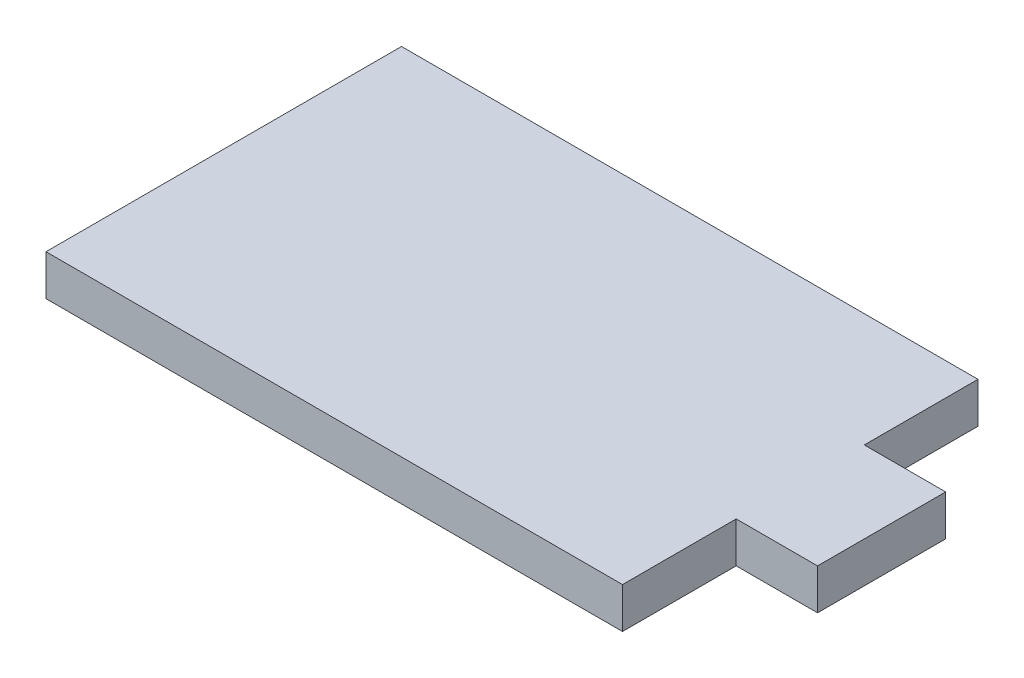
ISO-10303-21;
HEADER;
FILE_DESCRIPTION(('STEP AP214'),'2;1');
FILE_NAME('part.step','',(''),(''),'','','');
FILE_SCHEMA(('AUTOMOTIVE_DESIGN { 1 0 10303 214 1 1 1 1 }'));
ENDSEC;
DATA;
#1=APPLICATION_CONTEXT('core data for automotive mechanical design processes');
#2=APPLICATION_PROTOCOL_DEFINITION('international standard','automotive_design',2000,#1);
#3=PRODUCT_CONTEXT('',#1,'mechanical');
#4=PRODUCT('Part','Part','',(#3));
#5=PRODUCT_RELATED_PRODUCT_CATEGORY('part','',(#4));
#6=PRODUCT_DEFINITION_FORMATION('','',#4);
#7=PRODUCT_DEFINITION_CONTEXT('part definition',#1,'design');
#8=PRODUCT_DEFINITION('design','',#6,#7);
#9=PRODUCT_DEFINITION_SHAPE('','',#8);
#10=(LENGTH_UNIT() NAMED_UNIT(*) SI_UNIT(.MILLI.,.METRE.));
#11=(NAMED_UNIT(*) PLANE_ANGLE_UNIT() SI_UNIT($,.RADIAN.));
#12=(NAMED_UNIT(*) SI_UNIT($,.STERADIAN.) SOLID_ANGLE_UNIT());
#13=UNCERTAINTY_MEASURE_WITH_UNIT(LENGTH_MEASURE(1.E-05),#10,'distance_accuracy_value','');
#14=(GEOMETRIC_REPRESENTATION_CONTEXT(3) GLOBAL_UNCERTAINTY_ASSIGNED_CONTEXT((#13)) GLOBAL_UNIT_ASSIGNED_CONTEXT((#10,
#11,#12)) REPRESENTATION_CONTEXT('',''));
#15=CARTESIAN_POINT('',(0.,0.,0.));
#16=DIRECTION('',(0.,0.,1.));
#17=DIRECTION('',(1.,0.,0.));
#18=AXIS2_PLACEMENT_3D('',#15,#16,#17);
#19=CARTESIAN_POINT('',(-22.5,3.175,0.));
#20=DIRECTION('',(-1.,0.,0.));
#21=DIRECTION('',(0.,0.,1.));
#22=AXIS2_PLACEMENT_3D('',#19,#20,#21);
#23=PLANE('',#22);
#24=DIRECTION('',(0.,0.,-1.));
#25=VECTOR('',#24,1.);
#26=CARTESIAN_POINT('',(-22.5,0.,0.));
#27=LINE('',#26,#25);
#28=CARTESIAN_POINT('',(-22.5,0.,18.875));
#29=VERTEX_POINT('',#28);
#30=CARTESIAN_POINT('',(-22.5,0.,-8.875));
#31=VERTEX_POINT('',#30);
#32=EDGE_CURVE('E127',#29,#31,#27,.T.);
#33=ORIENTED_EDGE('',*,*,#32,.F.);
#34=DIRECTION('',(0.,-1.,0.));
#35=VECTOR('',#34,1.);
#36=CARTESIAN_POINT('',(-22.5,3.175,18.875));
#37=LINE('',#36,#35);
#38=CARTESIAN_POINT('',(-22.5,3.175,18.875));
#39=VERTEX_POINT('',#38);
#40=EDGE_CURVE('E11',#39,#29,#37,.T.);
#41=ORIENTED_EDGE('',*,*,#40,.F.);
#42=DIRECTION('',(0.,0.,-1.));
#43=VECTOR('',#42,1.);
#44=CARTESIAN_POINT('',(-22.5,3.175,0.));
#45=LINE('',#44,#43);
#46=CARTESIAN_POINT('',(-22.5,3.175,-8.875));
#47=VERTEX_POINT('',#46);
#48=EDGE_CURVE('E147',#39,#47,#45,.T.);
#49=ORIENTED_EDGE('',*,*,#48,.T.);
#50=DIRECTION('',(0.,-1.,0.));
#51=VECTOR('',#50,1.);
#52=CARTESIAN_POINT('',(-22.5,3.175,-8.875));
#53=LINE('',#52,#51);
#54=EDGE_CURVE('E50',#47,#31,#53,.T.);
#55=ORIENTED_EDGE('',*,*,#54,.T.);
#56=EDGE_LOOP('',(#33,#41,#49,#55));
#57=FACE_BOUND('',#56,.T.);
#58=ADVANCED_FACE('F34',(#57),#23,.T.);
#59=CARTESIAN_POINT('',(0.,3.175,18.875));
#60=DIRECTION('',(0.,0.,1.));
#61=DIRECTION('',(1.,0.,0.));
#62=AXIS2_PLACEMENT_3D('',#59,#60,#61);
#63=PLANE('',#62);
#64=DIRECTION('',(-1.,0.,0.));
#65=VECTOR('',#64,1.);
#66=CARTESIAN_POINT('',(0.,0.,18.875));
#67=LINE('',#66,#65);
#68=CARTESIAN_POINT('',(22.5,0.,18.875));
#69=VERTEX_POINT('',#68);
#70=EDGE_CURVE('E129',#69,#29,#67,.T.);
#71=ORIENTED_EDGE('',*,*,#70,.F.);
#72=DIRECTION('',(0.,-1.,0.));
#73=VECTOR('',#72,1.);
#74=CARTESIAN_POINT('',(22.5,3.175,18.875));
#75=LINE('',#74,#73);
#76=CARTESIAN_POINT('',(22.5,3.175,18.875));
#77=VERTEX_POINT('',#76);
#78=EDGE_CURVE('E42',#77,#69,#75,.T.);
#79=ORIENTED_EDGE('',*,*,#78,.F.);
#80=DIRECTION('',(-1.,0.,0.));
#81=VECTOR('',#80,1.);
#82=CARTESIAN_POINT('',(0.,3.175,18.875));
#83=LINE('',#82,#81);
#84=EDGE_CURVE('E173',#77,#39,#83,.T.);
#85=ORIENTED_EDGE('',*,*,#84,.T.);
#86=ORIENTED_EDGE('',*,*,#40,.T.);
#87=EDGE_LOOP('',(#71,#79,#85,#86));
#88=FACE_BOUND('',#87,.T.);
#89=ADVANCED_FACE('F164',(#88),#63,.T.);
#90=CARTESIAN_POINT('',(22.5,3.175,0.));
#91=DIRECTION('',(1.,0.,0.));
#92=DIRECTION('',(0.,0.,-1.));
#93=AXIS2_PLACEMENT_3D('',#90,#91,#92);
#94=PLANE('',#93);
#95=DIRECTION('',(0.,0.,1.));
#96=VECTOR('',#95,1.);
#97=CARTESIAN_POINT('',(22.5,0.,0.));
#98=LINE('',#97,#96);
#99=CARTESIAN_POINT('',(22.5,0.,9.99999999999998));
#100=VERTEX_POINT('',#99);
#101=EDGE_CURVE('E132',#100,#69,#98,.T.);
#102=ORIENTED_EDGE('',*,*,#101,.F.);
#103=DIRECTION('',(0.,-1.,0.));
#104=VECTOR('',#103,1.);
#105=CARTESIAN_POINT('',(22.5,3.175,9.99999999999998));
#106=LINE('',#105,#104);
#107=CARTESIAN_POINT('',(22.5,3.175,9.99999999999998));
#108=VERTEX_POINT('',#107);
#109=EDGE_CURVE('E153',#108,#100,#106,.T.);
#110=ORIENTED_EDGE('',*,*,#109,.F.);
#111=DIRECTION('',(0.,0.,1.));
#112=VECTOR('',#111,1.);
#113=CARTESIAN_POINT('',(22.5,3.175,0.));
#114=LINE('',#113,#112);
#115=EDGE_CURVE('E160',#108,#77,#114,.T.);
#116=ORIENTED_EDGE('',*,*,#115,.T.);
#117=ORIENTED_EDGE('',*,*,#78,.T.);
#118=EDGE_LOOP('',(#102,#110,#116,#117));
#119=FACE_BOUND('',#118,.T.);
#120=ADVANCED_FACE('F158',(#119),#94,.T.);
#121=CARTESIAN_POINT('',(0.,3.175,9.99999999999998));
#122=DIRECTION('',(0.,0.,1.));
#123=DIRECTION('',(1.,0.,0.));
#124=AXIS2_PLACEMENT_3D('',#121,#122,#123);
#125=PLANE('',#124);
#126=DIRECTION('',(-1.,0.,0.));
#127=VECTOR('',#126,1.);
#128=CARTESIAN_POINT('',(0.,0.,9.99999999999998));
#129=LINE('',#128,#127);
#130=CARTESIAN_POINT('',(28.85,0.,9.99999999999998));
#131=VERTEX_POINT('',#130);
#132=EDGE_CURVE('E135',#131,#100,#129,.T.);
#133=ORIENTED_EDGE('',*,*,#132,.F.);
#134=DIRECTION('',(0.,-1.,0.));
#135=VECTOR('',#134,1.);
#136=CARTESIAN_POINT('',(28.85,3.175,9.99999999999998));
#137=LINE('',#136,#135);
#138=CARTESIAN_POINT('',(28.85,3.175,9.99999999999998));
#139=VERTEX_POINT('',#138);
#140=EDGE_CURVE('E151',#139,#131,#137,.T.);
#141=ORIENTED_EDGE('',*,*,#140,.F.);
#142=DIRECTION('',(-1.,0.,0.));
#143=VECTOR('',#142,1.);
#144=CARTESIAN_POINT('',(0.,3.175,9.99999999999998));
#145=LINE('',#144,#143);
#146=EDGE_CURVE('E172',#139,#108,#145,.T.);
#147=ORIENTED_EDGE('',*,*,#146,.T.);
#148=ORIENTED_EDGE('',*,*,#109,.T.);
#149=EDGE_LOOP('',(#133,#141,#147,#148));
#150=FACE_BOUND('',#149,.T.);
#151=ADVANCED_FACE('F170',(#150),#125,.T.);
#152=CARTESIAN_POINT('',(28.85,3.175,0.));
#153=DIRECTION('',(1.,0.,0.));
#154=DIRECTION('',(0.,0.,-1.));
#155=AXIS2_PLACEMENT_3D('',#152,#153,#154);
#156=PLANE('',#155);
#157=DIRECTION('',(0.,0.,1.));
#158=VECTOR('',#157,1.);
#159=CARTESIAN_POINT('',(28.85,0.,0.));
#160=LINE('',#159,#158);
#161=CARTESIAN_POINT('',(28.85,0.,0.));
#162=VERTEX_POINT('',#161);
#163=EDGE_CURVE('E138',#162,#131,#160,.T.);
#164=ORIENTED_EDGE('',*,*,#163,.F.);
#165=DIRECTION('',(0.,-1.,0.));
#166=VECTOR('',#165,1.);
#167=CARTESIAN_POINT('',(28.85,3.175,0.));
#168=LINE('',#167,#166);
#169=CARTESIAN_POINT('',(28.85,3.175,0.));
#170=VERTEX_POINT('',#169);
#171=EDGE_CURVE('E109',#170,#162,#168,.T.);
#172=ORIENTED_EDGE('',*,*,#171,.F.);
#173=DIRECTION('',(0.,0.,1.));
#174=VECTOR('',#173,1.);
#175=CARTESIAN_POINT('',(28.85,3.175,0.));
#176=LINE('',#175,#174);
#177=EDGE_CURVE('E119',#170,#139,#176,.T.);
#178=ORIENTED_EDGE('',*,*,#177,.T.);
#179=ORIENTED_EDGE('',*,*,#140,.T.);
#180=EDGE_LOOP('',(#164,#172,#178,#179));
#181=FACE_BOUND('',#180,.T.);
#182=ADVANCED_FACE('F179',(#181),#156,.T.);
#183=CARTESIAN_POINT('',(0.,3.175,0.));
#184=DIRECTION('',(0.,0.,-1.));
#185=DIRECTION('',(-1.,0.,0.));
#186=AXIS2_PLACEMENT_3D('',#183,#184,#185);
#187=PLANE('',#186);
#188=DIRECTION('',(1.,0.,0.));
#189=VECTOR('',#188,1.);
#190=CARTESIAN_POINT('',(0.,0.,0.));
#191=LINE('',#190,#189);
#192=CARTESIAN_POINT('',(22.5,0.,0.));
#193=VERTEX_POINT('',#192);
#194=EDGE_CURVE('E105',#193,#162,#191,.T.);
#195=ORIENTED_EDGE('',*,*,#194,.F.);
#196=DIRECTION('',(0.,-1.,0.));
#197=VECTOR('',#196,1.);
#198=CARTESIAN_POINT('',(22.5,3.175,0.));
#199=LINE('',#198,#197);
#200=CARTESIAN_POINT('',(22.5,3.175,0.));
#201=VERTEX_POINT('',#200);
#202=EDGE_CURVE('E100',#201,#193,#199,.T.);
#203=ORIENTED_EDGE('',*,*,#202,.F.);
#204=DIRECTION('',(1.,0.,0.));
#205=VECTOR('',#204,1.);
#206=CARTESIAN_POINT('',(0.,3.175,0.));
#207=LINE('',#206,#205);
#208=EDGE_CURVE('E103',#201,#170,#207,.T.);
#209=ORIENTED_EDGE('',*,*,#208,.T.);
#210=ORIENTED_EDGE('',*,*,#171,.T.);
#211=EDGE_LOOP('',(#195,#203,#209,#210));
#212=FACE_BOUND('',#211,.T.);
#213=ADVANCED_FACE('F102',(#212),#187,.T.);
#214=CARTESIAN_POINT('',(22.5,3.175,0.));
#215=DIRECTION('',(1.,0.,0.));
#216=DIRECTION('',(0.,0.,-1.));
#217=AXIS2_PLACEMENT_3D('',#214,#215,#216);
#218=PLANE('',#217);
#219=DIRECTION('',(0.,0.,1.));
#220=VECTOR('',#219,1.);
#221=CARTESIAN_POINT('',(22.5,0.,0.));
#222=LINE('',#221,#220);
#223=CARTESIAN_POINT('',(22.5,0.,-8.875));
#224=VERTEX_POINT('',#223);
#225=EDGE_CURVE('E142',#224,#193,#222,.T.);
#226=ORIENTED_EDGE('',*,*,#225,.F.);
#227=DIRECTION('',(0.,-1.,0.));
#228=VECTOR('',#227,1.);
#229=CARTESIAN_POINT('',(22.5,3.175,-8.875));
#230=LINE('',#229,#228);
#231=CARTESIAN_POINT('',(22.5,3.175,-8.875));
#232=VERTEX_POINT('',#231);
#233=EDGE_CURVE('E75',#232,#224,#230,.T.);
#234=ORIENTED_EDGE('',*,*,#233,.F.);
#235=DIRECTION('',(0.,0.,1.));
#236=VECTOR('',#235,1.);
#237=CARTESIAN_POINT('',(22.5,3.175,0.));
#238=LINE('',#237,#236);
#239=EDGE_CURVE('E116',#232,#201,#238,.T.);
#240=ORIENTED_EDGE('',*,*,#239,.T.);
#241=ORIENTED_EDGE('',*,*,#202,.T.);
#242=EDGE_LOOP('',(#226,#234,#240,#241));
#243=FACE_BOUND('',#242,.T.);
#244=ADVANCED_FACE('F121',(#243),#218,.T.);
#245=CARTESIAN_POINT('',(0.,3.175,-8.875));
#246=DIRECTION('',(0.,0.,-1.));
#247=DIRECTION('',(-1.,0.,0.));
#248=AXIS2_PLACEMENT_3D('',#245,#246,#247);
#249=PLANE('',#248);
#250=DIRECTION('',(1.,0.,0.));
#251=VECTOR('',#250,1.);
#252=CARTESIAN_POINT('',(0.,0.,-8.875));
#253=LINE('',#252,#251);
#254=EDGE_CURVE('E144',#31,#224,#253,.T.);
#255=ORIENTED_EDGE('',*,*,#254,.F.);
#256=ORIENTED_EDGE('',*,*,#54,.F.);
#257=DIRECTION('',(1.,0.,0.));
#258=VECTOR('',#257,1.);
#259=CARTESIAN_POINT('',(0.,3.175,-8.875));
#260=LINE('',#259,#258);
#261=EDGE_CURVE('E122',#47,#232,#260,.T.);
#262=ORIENTED_EDGE('',*,*,#261,.T.);
#263=ORIENTED_EDGE('',*,*,#233,.T.);
#264=EDGE_LOOP('',(#255,#256,#262,#263));
#265=FACE_BOUND('',#264,.T.);
#266=ADVANCED_FACE('F180',(#265),#249,.T.);
#267=CARTESIAN_POINT('',(0.,3.175,0.));
#268=DIRECTION('',(0.,1.,0.));
#269=DIRECTION('',(0.,0.,1.));
#270=AXIS2_PLACEMENT_3D('',#267,#268,#269);
#271=PLANE('',#270);
#272=ORIENTED_EDGE('',*,*,#48,.F.);
#273=ORIENTED_EDGE('',*,*,#84,.F.);
#274=ORIENTED_EDGE('',*,*,#115,.F.);
#275=ORIENTED_EDGE('',*,*,#146,.F.);
#276=ORIENTED_EDGE('',*,*,#177,.F.);
#277=ORIENTED_EDGE('',*,*,#208,.F.);
#278=ORIENTED_EDGE('',*,*,#239,.F.);
#279=ORIENTED_EDGE('',*,*,#261,.F.);
#280=EDGE_LOOP('',(#272,#273,#274,#275,#276,#277,#278,#279));
#281=FACE_BOUND('',#280,.T.);
#282=ADVANCED_FACE('F114',(#281),#271,.T.);
#283=CARTESIAN_POINT('',(0.,0.,0.));
#284=DIRECTION('',(0.,1.,0.));
#285=DIRECTION('',(0.,0.,1.));
#286=AXIS2_PLACEMENT_3D('',#283,#284,#285);
#287=PLANE('',#286);
#288=ORIENTED_EDGE('',*,*,#32,.T.);
#289=ORIENTED_EDGE('',*,*,#254,.T.);
#290=ORIENTED_EDGE('',*,*,#225,.T.);
#291=ORIENTED_EDGE('',*,*,#194,.T.);
#292=ORIENTED_EDGE('',*,*,#163,.T.);
#293=ORIENTED_EDGE('',*,*,#132,.T.);
#294=ORIENTED_EDGE('',*,*,#101,.T.);
#295=ORIENTED_EDGE('',*,*,#70,.T.);
#296=EDGE_LOOP('',(#288,#289,#290,#291,#292,#293,#294,#295));
#297=FACE_BOUND('',#296,.T.);
#298=ADVANCED_FACE('F166',(#297),#287,.F.);
#299=CLOSED_SHELL('',(#58,#89,#120,#151,#182,#213,#244,#266,#282,#298));
#300=MANIFOLD_SOLID_BREP('B2',#299);
#301=ADVANCED_BREP_SHAPE_REPRESENTATION('',(#18,#300),#14);
#302=SHAPE_DEFINITION_REPRESENTATION(#9,#301);
ENDSEC;
END-ISO-10303-21;
